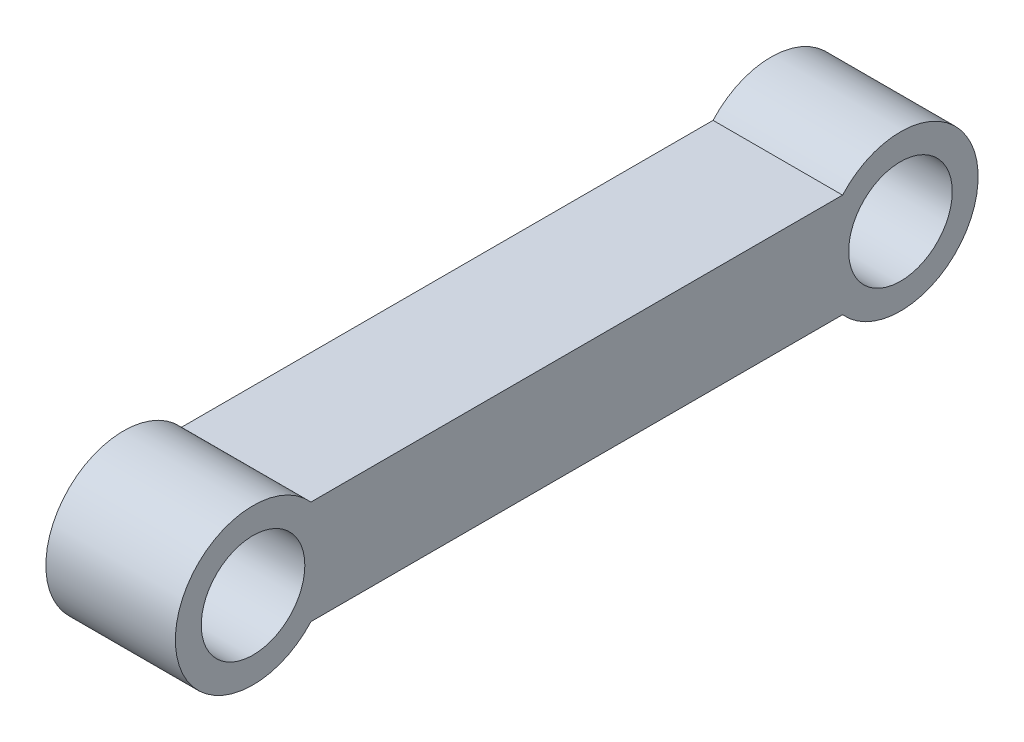
ISO-10303-21;
HEADER;
FILE_DESCRIPTION(('STEP AP214'),'2;1');
FILE_NAME('part.step','',(''),(''),'','','');
FILE_SCHEMA(('AUTOMOTIVE_DESIGN { 1 0 10303 214 1 1 1 1 }'));
ENDSEC;
DATA;
#1=APPLICATION_CONTEXT('core data for automotive mechanical design processes');
#2=APPLICATION_PROTOCOL_DEFINITION('international standard','automotive_design',2000,#1);
#3=PRODUCT_CONTEXT('',#1,'mechanical');
#4=PRODUCT('Part','Part','',(#3));
#5=PRODUCT_RELATED_PRODUCT_CATEGORY('part','',(#4));
#6=PRODUCT_DEFINITION_FORMATION('','',#4);
#7=PRODUCT_DEFINITION_CONTEXT('part definition',#1,'design');
#8=PRODUCT_DEFINITION('design','',#6,#7);
#9=PRODUCT_DEFINITION_SHAPE('','',#8);
#10=(LENGTH_UNIT() NAMED_UNIT(*) SI_UNIT(.MILLI.,.METRE.));
#11=(NAMED_UNIT(*) PLANE_ANGLE_UNIT() SI_UNIT($,.RADIAN.));
#12=(NAMED_UNIT(*) SI_UNIT($,.STERADIAN.) SOLID_ANGLE_UNIT());
#13=UNCERTAINTY_MEASURE_WITH_UNIT(LENGTH_MEASURE(1.E-05),#10,'distance_accuracy_value','');
#14=(GEOMETRIC_REPRESENTATION_CONTEXT(3) GLOBAL_UNCERTAINTY_ASSIGNED_CONTEXT((#13)) GLOBAL_UNIT_ASSIGNED_CONTEXT((#10,
#11,#12)) REPRESENTATION_CONTEXT('',''));
#15=CARTESIAN_POINT('',(0.,0.,0.));
#16=DIRECTION('',(0.,0.,1.));
#17=DIRECTION('',(1.,0.,0.));
#18=AXIS2_PLACEMENT_3D('',#15,#16,#17);
#19=CARTESIAN_POINT('',(100.,-226.263273144617,240.34553858004));
#20=DIRECTION('',(1.,0.,0.));
#21=DIRECTION('',(0.,0.,-1.));
#22=AXIS2_PLACEMENT_3D('',#19,#20,#21);
#23=PLANE('',#22);
#24=CARTESIAN_POINT('',(100.,-226.263273144619,-259.65446141996));
#25=DIRECTION('',(1.,0.,0.));
#26=DIRECTION('',(0.,0.,-1.));
#27=AXIS2_PLACEMENT_3D('',#24,#25,#26);
#28=CIRCLE('',#27,40.0000000000001);
#29=CARTESIAN_POINT('',(100.,-226.263273144619,-299.65446141996));
#30=VERTEX_POINT('',#29);
#31=EDGE_CURVE('E106',#30,#30,#28,.T.);
#32=ORIENTED_EDGE('',*,*,#31,.F.);
#33=EDGE_LOOP('',(#32));
#34=FACE_BOUND('',#33,.T.);
#35=CARTESIAN_POINT('',(100.,-226.263273144617,240.34553858004));
#36=DIRECTION('',(1.,0.,0.));
#37=DIRECTION('',(0.,0.,-1.));
#38=AXIS2_PLACEMENT_3D('',#35,#36,#37);
#39=CIRCLE('',#38,60.);
#40=CARTESIAN_POINT('',(100.,-186.263273144617,195.624179030044));
#41=VERTEX_POINT('',#40);
#42=CARTESIAN_POINT('',(100.,-266.263273144617,195.624179030044));
#43=VERTEX_POINT('',#42);
#44=EDGE_CURVE('E91',#41,#43,#39,.T.);
#45=ORIENTED_EDGE('',*,*,#44,.T.);
#46=DIRECTION('',(0.,0.,-1.));
#47=VECTOR('',#46,1.);
#48=CARTESIAN_POINT('',(100.,-266.263273144617,195.624179030044));
#49=LINE('',#48,#47);
#50=CARTESIAN_POINT('',(100.,-266.263273144618,-214.933101869964));
#51=VERTEX_POINT('',#50);
#52=EDGE_CURVE('E86',#43,#51,#49,.T.);
#53=ORIENTED_EDGE('',*,*,#52,.T.);
#54=CARTESIAN_POINT('',(100.,-226.263273144619,-259.65446141996));
#55=DIRECTION('',(1.,0.,0.));
#56=DIRECTION('',(0.,0.,-1.));
#57=AXIS2_PLACEMENT_3D('',#54,#55,#56);
#58=CIRCLE('',#57,60.);
#59=CARTESIAN_POINT('',(100.,-186.263273144618,-214.933101869965));
#60=VERTEX_POINT('',#59);
#61=EDGE_CURVE('E89',#51,#60,#58,.T.);
#62=ORIENTED_EDGE('',*,*,#61,.T.);
#63=DIRECTION('',(0.,0.,1.));
#64=VECTOR('',#63,1.);
#65=CARTESIAN_POINT('',(100.,-186.263273144617,195.624179030044));
#66=LINE('',#65,#64);
#67=EDGE_CURVE('E56',#60,#41,#66,.T.);
#68=ORIENTED_EDGE('',*,*,#67,.T.);
#69=EDGE_LOOP('',(#45,#53,#62,#68));
#70=FACE_BOUND('',#69,.T.);
#71=CARTESIAN_POINT('',(100.,-226.263273144617,240.34553858004));
#72=DIRECTION('',(1.,0.,0.));
#73=DIRECTION('',(0.,0.,-1.));
#74=AXIS2_PLACEMENT_3D('',#71,#72,#73);
#75=CIRCLE('',#74,39.9999999999999);
#76=CARTESIAN_POINT('',(100.,-226.263273144617,200.34553858004));
#77=VERTEX_POINT('',#76);
#78=EDGE_CURVE('E121',#77,#77,#75,.T.);
#79=ORIENTED_EDGE('',*,*,#78,.F.);
#80=EDGE_LOOP('',(#79));
#81=FACE_BOUND('',#80,.T.);
#82=ADVANCED_FACE('F39',(#34,#70,#81),#23,.T.);
#83=CARTESIAN_POINT('',(0.,-226.263273144617,240.34553858004));
#84=DIRECTION('',(1.,0.,0.));
#85=DIRECTION('',(0.,0.,-1.));
#86=AXIS2_PLACEMENT_3D('',#83,#84,#85);
#87=PLANE('',#86);
#88=CARTESIAN_POINT('',(0.,-226.263273144617,240.34553858004));
#89=DIRECTION('',(1.,0.,0.));
#90=DIRECTION('',(0.,0.,-1.));
#91=AXIS2_PLACEMENT_3D('',#88,#89,#90);
#92=CIRCLE('',#91,60.);
#93=CARTESIAN_POINT('',(0.,-186.263273144617,195.624179030044));
#94=VERTEX_POINT('',#93);
#95=CARTESIAN_POINT('',(0.,-266.263273144617,195.624179030044));
#96=VERTEX_POINT('',#95);
#97=EDGE_CURVE('E103',#94,#96,#92,.T.);
#98=ORIENTED_EDGE('',*,*,#97,.F.);
#99=DIRECTION('',(0.,0.,1.));
#100=VECTOR('',#99,1.);
#101=CARTESIAN_POINT('',(0.,-186.263273144617,195.624179030044));
#102=LINE('',#101,#100);
#103=CARTESIAN_POINT('',(0.,-186.263273144618,-214.933101869965));
#104=VERTEX_POINT('',#103);
#105=EDGE_CURVE('E79',#104,#94,#102,.T.);
#106=ORIENTED_EDGE('',*,*,#105,.F.);
#107=CARTESIAN_POINT('',(0.,-226.263273144619,-259.65446141996));
#108=DIRECTION('',(1.,0.,0.));
#109=DIRECTION('',(0.,0.,-1.));
#110=AXIS2_PLACEMENT_3D('',#107,#108,#109);
#111=CIRCLE('',#110,60.);
#112=CARTESIAN_POINT('',(0.,-266.263273144618,-214.933101869964));
#113=VERTEX_POINT('',#112);
#114=EDGE_CURVE('E73',#113,#104,#111,.T.);
#115=ORIENTED_EDGE('',*,*,#114,.F.);
#116=DIRECTION('',(0.,0.,-1.));
#117=VECTOR('',#116,1.);
#118=CARTESIAN_POINT('',(0.,-266.263273144617,195.624179030044));
#119=LINE('',#118,#117);
#120=EDGE_CURVE('E95',#96,#113,#119,.T.);
#121=ORIENTED_EDGE('',*,*,#120,.F.);
#122=EDGE_LOOP('',(#98,#106,#115,#121));
#123=FACE_BOUND('',#122,.T.);
#124=CARTESIAN_POINT('',(0.,-226.263273144619,-259.65446141996));
#125=DIRECTION('',(1.,0.,0.));
#126=DIRECTION('',(0.,0.,-1.));
#127=AXIS2_PLACEMENT_3D('',#124,#125,#126);
#128=CIRCLE('',#127,40.0000000000001);
#129=CARTESIAN_POINT('',(0.,-226.263273144619,-299.65446141996));
#130=VERTEX_POINT('',#129);
#131=EDGE_CURVE('E118',#130,#130,#128,.T.);
#132=ORIENTED_EDGE('',*,*,#131,.T.);
#133=EDGE_LOOP('',(#132));
#134=FACE_BOUND('',#133,.T.);
#135=CARTESIAN_POINT('',(0.,-226.263273144617,240.34553858004));
#136=DIRECTION('',(1.,0.,0.));
#137=DIRECTION('',(0.,0.,-1.));
#138=AXIS2_PLACEMENT_3D('',#135,#136,#137);
#139=CIRCLE('',#138,39.9999999999999);
#140=CARTESIAN_POINT('',(0.,-226.263273144617,200.34553858004));
#141=VERTEX_POINT('',#140);
#142=EDGE_CURVE('E124',#141,#141,#139,.T.);
#143=ORIENTED_EDGE('',*,*,#142,.T.);
#144=EDGE_LOOP('',(#143));
#145=FACE_BOUND('',#144,.T.);
#146=ADVANCED_FACE('F114',(#123,#134,#145),#87,.F.);
#147=CARTESIAN_POINT('',(100.,-226.263273144617,240.34553858004));
#148=DIRECTION('',(-1.,0.,0.));
#149=DIRECTION('',(0.,0.,1.));
#150=AXIS2_PLACEMENT_3D('',#147,#148,#149);
#151=CYLINDRICAL_SURFACE('',#150,60.);
#152=ORIENTED_EDGE('',*,*,#97,.T.);
#153=DIRECTION('',(-1.,0.,0.));
#154=VECTOR('',#153,1.);
#155=CARTESIAN_POINT('',(100.,-266.263273144617,195.624179030044));
#156=LINE('',#155,#154);
#157=EDGE_CURVE('E11',#43,#96,#156,.T.);
#158=ORIENTED_EDGE('',*,*,#157,.F.);
#159=ORIENTED_EDGE('',*,*,#44,.F.);
#160=DIRECTION('',(-1.,0.,0.));
#161=VECTOR('',#160,1.);
#162=CARTESIAN_POINT('',(100.,-186.263273144617,195.624179030044));
#163=LINE('',#162,#161);
#164=EDGE_CURVE('E99',#41,#94,#163,.T.);
#165=ORIENTED_EDGE('',*,*,#164,.T.);
#166=EDGE_LOOP('',(#152,#158,#159,#165));
#167=FACE_BOUND('',#166,.T.);
#168=ADVANCED_FACE('F41',(#167),#151,.T.);
#169=CARTESIAN_POINT('',(100.,-266.263273144617,195.624179030044));
#170=DIRECTION('',(0.,1.,0.));
#171=DIRECTION('',(0.,0.,1.));
#172=AXIS2_PLACEMENT_3D('',#169,#170,#171);
#173=PLANE('',#172);
#174=ORIENTED_EDGE('',*,*,#120,.T.);
#175=DIRECTION('',(-1.,0.,0.));
#176=VECTOR('',#175,1.);
#177=CARTESIAN_POINT('',(100.,-266.263273144618,-214.933101869964));
#178=LINE('',#177,#176);
#179=EDGE_CURVE('E48',#51,#113,#178,.T.);
#180=ORIENTED_EDGE('',*,*,#179,.F.);
#181=ORIENTED_EDGE('',*,*,#52,.F.);
#182=ORIENTED_EDGE('',*,*,#157,.T.);
#183=EDGE_LOOP('',(#174,#180,#181,#182));
#184=FACE_BOUND('',#183,.T.);
#185=ADVANCED_FACE('F94',(#184),#173,.F.);
#186=CARTESIAN_POINT('',(100.,-226.263273144619,-259.65446141996));
#187=DIRECTION('',(-1.,0.,0.));
#188=DIRECTION('',(0.,0.,1.));
#189=AXIS2_PLACEMENT_3D('',#186,#187,#188);
#190=CYLINDRICAL_SURFACE('',#189,60.);
#191=ORIENTED_EDGE('',*,*,#114,.T.);
#192=DIRECTION('',(-1.,0.,0.));
#193=VECTOR('',#192,1.);
#194=CARTESIAN_POINT('',(100.,-186.263273144618,-214.933101869965));
#195=LINE('',#194,#193);
#196=EDGE_CURVE('E96',#60,#104,#195,.T.);
#197=ORIENTED_EDGE('',*,*,#196,.F.);
#198=ORIENTED_EDGE('',*,*,#61,.F.);
#199=ORIENTED_EDGE('',*,*,#179,.T.);
#200=EDGE_LOOP('',(#191,#197,#198,#199));
#201=FACE_BOUND('',#200,.T.);
#202=ADVANCED_FACE('F97',(#201),#190,.T.);
#203=CARTESIAN_POINT('',(100.,-186.263273144617,195.624179030044));
#204=DIRECTION('',(0.,-1.,0.));
#205=DIRECTION('',(0.,0.,-1.));
#206=AXIS2_PLACEMENT_3D('',#203,#204,#205);
#207=PLANE('',#206);
#208=ORIENTED_EDGE('',*,*,#105,.T.);
#209=ORIENTED_EDGE('',*,*,#164,.F.);
#210=ORIENTED_EDGE('',*,*,#67,.F.);
#211=ORIENTED_EDGE('',*,*,#196,.T.);
#212=EDGE_LOOP('',(#208,#209,#210,#211));
#213=FACE_BOUND('',#212,.T.);
#214=ADVANCED_FACE('F111',(#213),#207,.F.);
#215=CARTESIAN_POINT('',(100.,-226.263273144619,-259.65446141996));
#216=DIRECTION('',(-1.,0.,0.));
#217=DIRECTION('',(0.,0.,1.));
#218=AXIS2_PLACEMENT_3D('',#215,#216,#217);
#219=CYLINDRICAL_SURFACE('',#218,40.0000000000001);
#220=ORIENTED_EDGE('',*,*,#31,.T.);
#221=EDGE_LOOP('',(#220));
#222=FACE_BOUND('',#221,.T.);
#223=ORIENTED_EDGE('',*,*,#131,.F.);
#224=EDGE_LOOP('',(#223));
#225=FACE_BOUND('',#224,.T.);
#226=ADVANCED_FACE('F141',(#222,#225),#219,.F.);
#227=CARTESIAN_POINT('',(100.,-226.263273144617,240.34553858004));
#228=DIRECTION('',(-1.,0.,0.));
#229=DIRECTION('',(0.,0.,1.));
#230=AXIS2_PLACEMENT_3D('',#227,#228,#229);
#231=CYLINDRICAL_SURFACE('',#230,39.9999999999999);
#232=ORIENTED_EDGE('',*,*,#78,.T.);
#233=EDGE_LOOP('',(#232));
#234=FACE_BOUND('',#233,.T.);
#235=ORIENTED_EDGE('',*,*,#142,.F.);
#236=EDGE_LOOP('',(#235));
#237=FACE_BOUND('',#236,.T.);
#238=ADVANCED_FACE('F130',(#234,#237),#231,.F.);
#239=CLOSED_SHELL('',(#82,#146,#168,#185,#202,#214,#226,#238));
#240=MANIFOLD_SOLID_BREP('B2',#239);
#241=ADVANCED_BREP_SHAPE_REPRESENTATION('',(#18,#240),#14);
#242=SHAPE_DEFINITION_REPRESENTATION(#9,#241);
ENDSEC;
END-ISO-10303-21;
